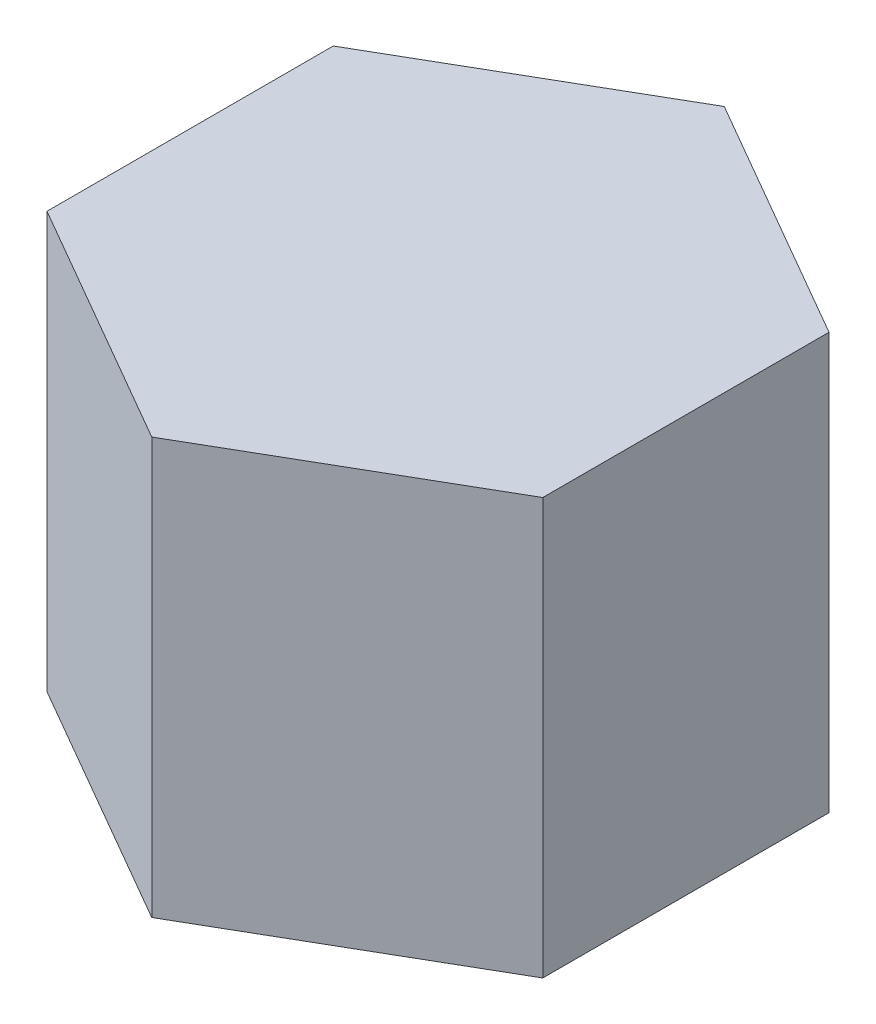
ISO-10303-21;
HEADER;
FILE_DESCRIPTION(('STEP AP214'),'2;1');
FILE_NAME('part.step','',(''),(''),'','','');
FILE_SCHEMA(('AUTOMOTIVE_DESIGN { 1 0 10303 214 1 1 1 1 }'));
ENDSEC;
DATA;
#1=APPLICATION_CONTEXT('core data for automotive mechanical design processes');
#2=APPLICATION_PROTOCOL_DEFINITION('international standard','automotive_design',2000,#1);
#3=PRODUCT_CONTEXT('',#1,'mechanical');
#4=PRODUCT('Part','Part','',(#3));
#5=PRODUCT_RELATED_PRODUCT_CATEGORY('part','',(#4));
#6=PRODUCT_DEFINITION_FORMATION('','',#4);
#7=PRODUCT_DEFINITION_CONTEXT('part definition',#1,'design');
#8=PRODUCT_DEFINITION('design','',#6,#7);
#9=PRODUCT_DEFINITION_SHAPE('','',#8);
#10=(LENGTH_UNIT() NAMED_UNIT(*) SI_UNIT(.MILLI.,.METRE.));
#11=(NAMED_UNIT(*) PLANE_ANGLE_UNIT() SI_UNIT($,.RADIAN.));
#12=(NAMED_UNIT(*) SI_UNIT($,.STERADIAN.) SOLID_ANGLE_UNIT());
#13=UNCERTAINTY_MEASURE_WITH_UNIT(LENGTH_MEASURE(1.E-05),#10,'distance_accuracy_value','');
#14=(GEOMETRIC_REPRESENTATION_CONTEXT(3) GLOBAL_UNCERTAINTY_ASSIGNED_CONTEXT((#13)) GLOBAL_UNIT_ASSIGNED_CONTEXT((#10,
#11,#12)) REPRESENTATION_CONTEXT('',''));
#15=CARTESIAN_POINT('',(0.,0.,0.));
#16=DIRECTION('',(0.,0.,1.));
#17=DIRECTION('',(1.,0.,0.));
#18=AXIS2_PLACEMENT_3D('',#15,#16,#17);
#19=CARTESIAN_POINT('',(203.339551417382,-147.556598747966,295.146072835632));
#20=DIRECTION('',(-0.500000000000096,0.,-0.866025403784383));
#21=DIRECTION('',(-0.866025403784383,0.,0.500000000000096));
#22=AXIS2_PLACEMENT_3D('',#19,#20,#21);
#23=PLANE('',#22);
#24=CARTESIAN_POINT('',(203.642660308706,-147.047793579175,294.971072835632));
#25=DIRECTION('',(-0.866025403784383,0.,0.500000000000096));
#26=VECTOR('',#25,1.);
#27=LINE('',#24,#26);
#28=CARTESIAN_POINT('',(203.642660308706,-147.047793579175,294.971072835632));
#29=VERTEX_POINT('',#28);
#30=CARTESIAN_POINT('',(203.339551417382,-147.047793579175,295.146072835632));
#31=VERTEX_POINT('',#30);
#32=EDGE_CURVE('E170',#29,#31,#27,.T.);
#33=ORIENTED_EDGE('',*,*,#32,.T.);
#34=CARTESIAN_POINT('',(203.339551417382,-147.556598747966,295.146072835632));
#35=DIRECTION('',(0.,1.,0.));
#36=VECTOR('',#35,1.);
#37=LINE('',#34,#36);
#38=CARTESIAN_POINT('',(203.339551417382,-147.556598747966,295.146072835632));
#39=VERTEX_POINT('',#38);
#40=EDGE_CURVE('E35',#39,#31,#37,.T.);
#41=ORIENTED_EDGE('',*,*,#40,.F.);
#42=CARTESIAN_POINT('',(203.642660308706,-147.556598747966,294.971072835632));
#43=DIRECTION('',(-0.866025403784383,0.,0.500000000000096));
#44=VECTOR('',#43,1.);
#45=LINE('',#42,#44);
#46=CARTESIAN_POINT('',(203.642660308706,-147.556598747966,294.971072835632));
#47=VERTEX_POINT('',#46);
#48=EDGE_CURVE('E159',#47,#39,#45,.T.);
#49=ORIENTED_EDGE('',*,*,#48,.F.);
#50=CARTESIAN_POINT('',(203.642660308706,-147.556598747966,294.971072835632));
#51=DIRECTION('',(0.,1.,0.));
#52=VECTOR('',#51,1.);
#53=LINE('',#50,#52);
#54=EDGE_CURVE('E10',#47,#29,#53,.T.);
#55=ORIENTED_EDGE('',*,*,#54,.T.);
#56=EDGE_LOOP('',(#33,#41,#49,#55));
#57=FACE_BOUND('',#56,.T.);
#58=ADVANCED_FACE('F16',(#57),#23,.F.);
#59=CARTESIAN_POINT('',(203.642660308706,-147.556598747966,291.594471220494));
#60=DIRECTION('',(-1.,0.,0.));
#61=DIRECTION('',(0.,-1.,0.));
#62=AXIS2_PLACEMENT_3D('',#59,#60,#61);
#63=PLANE('',#62);
#64=CARTESIAN_POINT('',(203.642660308706,-147.047793579175,294.621072835632));
#65=DIRECTION('',(0.,0.,1.));
#66=VECTOR('',#65,1.);
#67=LINE('',#64,#66);
#68=CARTESIAN_POINT('',(203.642660308706,-147.047793579175,294.621072835632));
#69=VERTEX_POINT('',#68);
#70=EDGE_CURVE('E167',#69,#29,#67,.T.);
#71=ORIENTED_EDGE('',*,*,#70,.T.);
#72=ORIENTED_EDGE('',*,*,#54,.F.);
#73=CARTESIAN_POINT('',(203.642660308706,-147.556598747966,294.621072835632));
#74=DIRECTION('',(0.,0.,1.));
#75=VECTOR('',#74,1.);
#76=LINE('',#73,#75);
#77=CARTESIAN_POINT('',(203.642660308706,-147.556598747966,294.621072835632));
#78=VERTEX_POINT('',#77);
#79=EDGE_CURVE('E156',#78,#47,#76,.T.);
#80=ORIENTED_EDGE('',*,*,#79,.F.);
#81=CARTESIAN_POINT('',(203.642660308706,-147.556598747966,294.621072835632));
#82=DIRECTION('',(0.,1.,0.));
#83=VECTOR('',#82,1.);
#84=LINE('',#81,#83);
#85=EDGE_CURVE('E27',#78,#69,#84,.T.);
#86=ORIENTED_EDGE('',*,*,#85,.T.);
#87=EDGE_LOOP('',(#71,#72,#80,#86));
#88=FACE_BOUND('',#87,.T.);
#89=ADVANCED_FACE('F189',(#88),#63,.F.);
#90=CARTESIAN_POINT('',(203.642660308706,-147.556598747966,294.621072835632));
#91=DIRECTION('',(-0.499999999999978,0.,0.866025403784452));
#92=DIRECTION('',(0.866025403784452,0.,0.499999999999978));
#93=AXIS2_PLACEMENT_3D('',#90,#91,#92);
#94=PLANE('',#93);
#95=CARTESIAN_POINT('',(203.339551417382,-147.047793579175,294.446072835632));
#96=DIRECTION('',(0.866025403784452,0.,0.499999999999978));
#97=VECTOR('',#96,1.);
#98=LINE('',#95,#97);
#99=CARTESIAN_POINT('',(203.339551417382,-147.047793579175,294.446072835632));
#100=VERTEX_POINT('',#99);
#101=EDGE_CURVE('E163',#100,#69,#98,.T.);
#102=ORIENTED_EDGE('',*,*,#101,.T.);
#103=ORIENTED_EDGE('',*,*,#85,.F.);
#104=CARTESIAN_POINT('',(203.339551417382,-147.556598747966,294.446072835632));
#105=DIRECTION('',(0.866025403784452,0.,0.499999999999978));
#106=VECTOR('',#105,1.);
#107=LINE('',#104,#106);
#108=CARTESIAN_POINT('',(203.339551417382,-147.556598747966,294.446072835632));
#109=VERTEX_POINT('',#108);
#110=EDGE_CURVE('E106',#109,#78,#107,.T.);
#111=ORIENTED_EDGE('',*,*,#110,.F.);
#112=CARTESIAN_POINT('',(203.339551417382,-147.556598747966,294.446072835632));
#113=DIRECTION('',(0.,1.,0.));
#114=VECTOR('',#113,1.);
#115=LINE('',#112,#114);
#116=EDGE_CURVE('E94',#109,#100,#115,.T.);
#117=ORIENTED_EDGE('',*,*,#116,.T.);
#118=EDGE_LOOP('',(#102,#103,#111,#117));
#119=FACE_BOUND('',#118,.T.);
#120=ADVANCED_FACE('F198',(#119),#94,.F.);
#121=CARTESIAN_POINT('',(203.339551417382,-147.556598747966,294.446072835632));
#122=DIRECTION('',(0.499999999999978,0.,0.866025403784452));
#123=DIRECTION('',(0.866025403784452,0.,-0.499999999999978));
#124=AXIS2_PLACEMENT_3D('',#121,#122,#123);
#125=PLANE('',#124);
#126=CARTESIAN_POINT('',(203.036442526057,-147.047793579175,294.621072835632));
#127=DIRECTION('',(0.866025403784452,0.,-0.499999999999978));
#128=VECTOR('',#127,1.);
#129=LINE('',#126,#128);
#130=CARTESIAN_POINT('',(203.036442526057,-147.047793579175,294.621072835632));
#131=VERTEX_POINT('',#130);
#132=EDGE_CURVE('E162',#131,#100,#129,.T.);
#133=ORIENTED_EDGE('',*,*,#132,.T.);
#134=ORIENTED_EDGE('',*,*,#116,.F.);
#135=CARTESIAN_POINT('',(203.036442526057,-147.556598747966,294.621072835632));
#136=DIRECTION('',(0.866025403784452,0.,-0.499999999999978));
#137=VECTOR('',#136,1.);
#138=LINE('',#135,#137);
#139=CARTESIAN_POINT('',(203.036442526057,-147.556598747966,294.621072835632));
#140=VERTEX_POINT('',#139);
#141=EDGE_CURVE('E98',#140,#109,#138,.T.);
#142=ORIENTED_EDGE('',*,*,#141,.F.);
#143=CARTESIAN_POINT('',(203.036442526057,-147.556598747966,294.621072835632));
#144=DIRECTION('',(0.,1.,0.));
#145=VECTOR('',#144,1.);
#146=LINE('',#143,#145);
#147=EDGE_CURVE('E79',#140,#131,#146,.T.);
#148=ORIENTED_EDGE('',*,*,#147,.T.);
#149=EDGE_LOOP('',(#133,#134,#142,#148));
#150=FACE_BOUND('',#149,.T.);
#151=ADVANCED_FACE('F100',(#150),#125,.F.);
#152=CARTESIAN_POINT('',(203.036442526057,-147.556598747966,291.594471220494));
#153=DIRECTION('',(1.,0.,0.));
#154=DIRECTION('',(0.,1.,0.));
#155=AXIS2_PLACEMENT_3D('',#152,#153,#154);
#156=PLANE('',#155);
#157=CARTESIAN_POINT('',(203.036442526057,-147.047793579175,294.971072835632));
#158=DIRECTION('',(0.,0.,-1.));
#159=VECTOR('',#158,1.);
#160=LINE('',#157,#159);
#161=CARTESIAN_POINT('',(203.036442526057,-147.047793579175,294.971072835632));
#162=VERTEX_POINT('',#161);
#163=EDGE_CURVE('E88',#162,#131,#160,.T.);
#164=ORIENTED_EDGE('',*,*,#163,.T.);
#165=ORIENTED_EDGE('',*,*,#147,.F.);
#166=CARTESIAN_POINT('',(203.036442526057,-147.556598747966,294.971072835632));
#167=DIRECTION('',(0.,0.,-1.));
#168=VECTOR('',#167,1.);
#169=LINE('',#166,#168);
#170=CARTESIAN_POINT('',(203.036442526057,-147.556598747966,294.971072835632));
#171=VERTEX_POINT('',#170);
#172=EDGE_CURVE('E84',#171,#140,#169,.T.);
#173=ORIENTED_EDGE('',*,*,#172,.F.);
#174=CARTESIAN_POINT('',(203.036442526057,-147.556598747966,294.971072835632));
#175=DIRECTION('',(0.,1.,0.));
#176=VECTOR('',#175,1.);
#177=LINE('',#174,#176);
#178=EDGE_CURVE('E58',#171,#162,#177,.T.);
#179=ORIENTED_EDGE('',*,*,#178,.T.);
#180=EDGE_LOOP('',(#164,#165,#173,#179));
#181=FACE_BOUND('',#180,.T.);
#182=ADVANCED_FACE('F82',(#181),#156,.F.);
#183=CARTESIAN_POINT('',(203.036442526057,-147.556598747966,294.971072835632));
#184=DIRECTION('',(0.499999999999978,0.,-0.866025403784452));
#185=DIRECTION('',(-0.866025403784452,0.,-0.499999999999978));
#186=AXIS2_PLACEMENT_3D('',#183,#184,#185);
#187=PLANE('',#186);
#188=CARTESIAN_POINT('',(203.339551417382,-147.047793579175,295.146072835632));
#189=DIRECTION('',(-0.866025403784452,0.,-0.499999999999978));
#190=VECTOR('',#189,1.);
#191=LINE('',#188,#190);
#192=EDGE_CURVE('E160',#31,#162,#191,.T.);
#193=ORIENTED_EDGE('',*,*,#192,.T.);
#194=ORIENTED_EDGE('',*,*,#178,.F.);
#195=CARTESIAN_POINT('',(203.339551417382,-147.556598747966,295.146072835632));
#196=DIRECTION('',(-0.866025403784452,0.,-0.499999999999978));
#197=VECTOR('',#196,1.);
#198=LINE('',#195,#197);
#199=EDGE_CURVE('E112',#39,#171,#198,.T.);
#200=ORIENTED_EDGE('',*,*,#199,.F.);
#201=ORIENTED_EDGE('',*,*,#40,.T.);
#202=EDGE_LOOP('',(#193,#194,#200,#201));
#203=FACE_BOUND('',#202,.T.);
#204=ADVANCED_FACE('F131',(#203),#187,.F.);
#205=CARTESIAN_POINT('',(206.491105863044,-147.556598747966,291.594471220494));
#206=DIRECTION('',(0.,1.,0.));
#207=DIRECTION('',(-1.,0.,0.));
#208=AXIS2_PLACEMENT_3D('',#205,#206,#207);
#209=PLANE('',#208);
#210=ORIENTED_EDGE('',*,*,#48,.T.);
#211=ORIENTED_EDGE('',*,*,#199,.T.);
#212=ORIENTED_EDGE('',*,*,#172,.T.);
#213=ORIENTED_EDGE('',*,*,#141,.T.);
#214=ORIENTED_EDGE('',*,*,#110,.T.);
#215=ORIENTED_EDGE('',*,*,#79,.T.);
#216=EDGE_LOOP('',(#210,#211,#212,#213,#214,#215));
#217=FACE_BOUND('',#216,.T.);
#218=ADVANCED_FACE('F111',(#217),#209,.F.);
#219=CARTESIAN_POINT('',(206.491105863044,-147.047793579175,291.594471220494));
#220=DIRECTION('',(0.,1.,0.));
#221=DIRECTION('',(-1.,0.,0.));
#222=AXIS2_PLACEMENT_3D('',#219,#220,#221);
#223=PLANE('',#222);
#224=ORIENTED_EDGE('',*,*,#32,.F.);
#225=ORIENTED_EDGE('',*,*,#70,.F.);
#226=ORIENTED_EDGE('',*,*,#101,.F.);
#227=ORIENTED_EDGE('',*,*,#132,.F.);
#228=ORIENTED_EDGE('',*,*,#163,.F.);
#229=ORIENTED_EDGE('',*,*,#192,.F.);
#230=EDGE_LOOP('',(#224,#225,#226,#227,#228,#229));
#231=FACE_BOUND('',#230,.T.);
#232=ADVANCED_FACE('F130',(#231),#223,.T.);
#233=CLOSED_SHELL('',(#58,#89,#120,#151,#182,#204,#218,#232));
#234=MANIFOLD_SOLID_BREP('B1',#233);
#235=ADVANCED_BREP_SHAPE_REPRESENTATION('',(#18,#234),#14);
#236=SHAPE_DEFINITION_REPRESENTATION(#9,#235);
ENDSEC;
END-ISO-10303-21;
